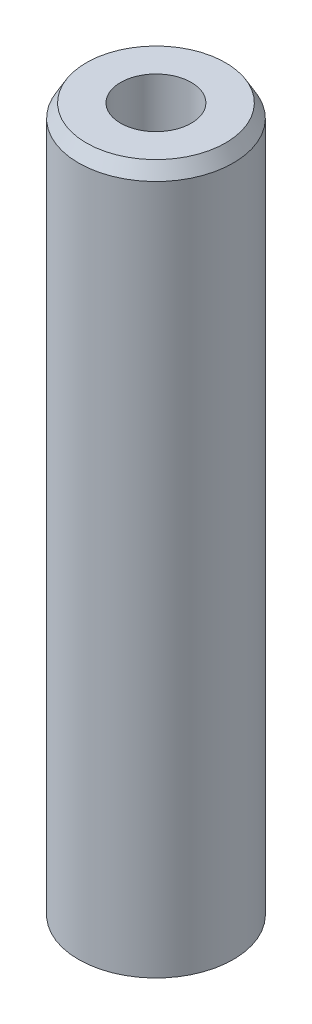
ISO-10303-21;
HEADER;
FILE_DESCRIPTION(('STEP AP214'),'2;1');
FILE_NAME('part.step','',(''),(''),'','','');
FILE_SCHEMA(('AUTOMOTIVE_DESIGN { 1 0 10303 214 1 1 1 1 }'));
ENDSEC;
DATA;
#1=APPLICATION_CONTEXT('core data for automotive mechanical design processes');
#2=APPLICATION_PROTOCOL_DEFINITION('international standard','automotive_design',2000,#1);
#3=PRODUCT_CONTEXT('',#1,'mechanical');
#4=PRODUCT('Part','Part','',(#3));
#5=PRODUCT_RELATED_PRODUCT_CATEGORY('part','',(#4));
#6=PRODUCT_DEFINITION_FORMATION('','',#4);
#7=PRODUCT_DEFINITION_CONTEXT('part definition',#1,'design');
#8=PRODUCT_DEFINITION('design','',#6,#7);
#9=PRODUCT_DEFINITION_SHAPE('','',#8);
#10=(LENGTH_UNIT() NAMED_UNIT(*) SI_UNIT(.MILLI.,.METRE.));
#11=(NAMED_UNIT(*) PLANE_ANGLE_UNIT() SI_UNIT($,.RADIAN.));
#12=(NAMED_UNIT(*) SI_UNIT($,.STERADIAN.) SOLID_ANGLE_UNIT());
#13=UNCERTAINTY_MEASURE_WITH_UNIT(LENGTH_MEASURE(1.E-05),#10,'distance_accuracy_value','');
#14=(GEOMETRIC_REPRESENTATION_CONTEXT(3) GLOBAL_UNCERTAINTY_ASSIGNED_CONTEXT((#13)) GLOBAL_UNIT_ASSIGNED_CONTEXT((#10,
#11,#12)) REPRESENTATION_CONTEXT('',''));
#15=CARTESIAN_POINT('',(0.,0.,0.));
#16=DIRECTION('',(0.,0.,1.));
#17=DIRECTION('',(1.,0.,0.));
#18=AXIS2_PLACEMENT_3D('',#15,#16,#17);
#19=CARTESIAN_POINT('',(0.,298.679103880782,0.));
#20=DIRECTION('',(0.,-1.,0.));
#21=DIRECTION('',(0.,0.,-1.));
#22=AXIS2_PLACEMENT_3D('',#19,#20,#21);
#23=CYLINDRICAL_SURFACE('',#22,32.5);
#24=CARTESIAN_POINT('',(0.,293.018940821755,0.));
#25=DIRECTION('',(0.,1.,0.));
#26=DIRECTION('',(0.,0.,1.));
#27=AXIS2_PLACEMENT_3D('',#24,#25,#26);
#28=CIRCLE('',#27,32.5);
#29=CARTESIAN_POINT('',(0.,293.018940821755,32.5));
#30=VERTEX_POINT('',#29);
#31=EDGE_CURVE('E50',#30,#30,#28,.F.);
#32=ORIENTED_EDGE('',*,*,#31,.T.);
#33=EDGE_LOOP('',(#32));
#34=FACE_BOUND('',#33,.T.);
#35=CARTESIAN_POINT('',(0.,3.26789666578603,0.));
#36=DIRECTION('',(0.,1.,0.));
#37=DIRECTION('',(0.,0.,1.));
#38=AXIS2_PLACEMENT_3D('',#35,#36,#37);
#39=CIRCLE('',#38,32.5);
#40=CARTESIAN_POINT('',(0.,3.26789666578603,32.5));
#41=VERTEX_POINT('',#40);
#42=EDGE_CURVE('E51',#41,#41,#39,.T.);
#43=ORIENTED_EDGE('',*,*,#42,.T.);
#44=EDGE_LOOP('',(#43));
#45=FACE_BOUND('',#44,.T.);
#46=ADVANCED_FACE('F39',(#34,#45),#23,.T.);
#47=CARTESIAN_POINT('',(0.,298.679103880782,0.));
#48=DIRECTION('',(0.,1.,0.));
#49=DIRECTION('',(0.,0.,1.));
#50=AXIS2_PLACEMENT_3D('',#47,#48,#49);
#51=PLANE('',#50);
#52=CARTESIAN_POINT('',(0.,298.679103880782,0.));
#53=DIRECTION('',(0.,1.,0.));
#54=DIRECTION('',(0.,0.,1.));
#55=AXIS2_PLACEMENT_3D('',#52,#53,#54);
#56=CIRCLE('',#55,29.232103334214);
#57=CARTESIAN_POINT('',(0.,298.679103880782,29.232103334214));
#58=VERTEX_POINT('',#57);
#59=EDGE_CURVE('E54',#58,#58,#56,.T.);
#60=ORIENTED_EDGE('',*,*,#59,.T.);
#61=EDGE_LOOP('',(#60));
#62=FACE_BOUND('',#61,.T.);
#63=CARTESIAN_POINT('',(0.,298.679103880782,0.));
#64=DIRECTION('',(0.,1.,0.));
#65=DIRECTION('',(0.,0.,1.));
#66=AXIS2_PLACEMENT_3D('',#63,#64,#65);
#67=CIRCLE('',#66,14.8529638655872);
#68=CARTESIAN_POINT('',(0.,298.679103880782,14.8529638655872));
#69=VERTEX_POINT('',#68);
#70=EDGE_CURVE('E58',#69,#69,#67,.T.);
#71=ORIENTED_EDGE('',*,*,#70,.F.);
#72=EDGE_LOOP('',(#71));
#73=FACE_BOUND('',#72,.T.);
#74=ADVANCED_FACE('F69',(#62,#73),#51,.T.);
#75=CARTESIAN_POINT('',(0.,0.,0.));
#76=DIRECTION('',(0.,1.,0.));
#77=DIRECTION('',(0.,0.,1.));
#78=AXIS2_PLACEMENT_3D('',#75,#76,#77);
#79=PLANE('',#78);
#80=CARTESIAN_POINT('',(0.,0.,0.));
#81=DIRECTION('',(0.,1.,0.));
#82=DIRECTION('',(0.,0.,1.));
#83=AXIS2_PLACEMENT_3D('',#80,#81,#82);
#84=CIRCLE('',#83,26.8398369409737);
#85=CARTESIAN_POINT('',(0.,0.,26.8398369409737));
#86=VERTEX_POINT('',#85);
#87=EDGE_CURVE('E10',#86,#86,#84,.F.);
#88=ORIENTED_EDGE('',*,*,#87,.T.);
#89=EDGE_LOOP('',(#88));
#90=FACE_BOUND('',#89,.T.);
#91=CARTESIAN_POINT('',(0.,0.,0.));
#92=DIRECTION('',(0.,1.,0.));
#93=DIRECTION('',(0.,0.,1.));
#94=AXIS2_PLACEMENT_3D('',#91,#92,#93);
#95=CIRCLE('',#94,14.8529638655872);
#96=CARTESIAN_POINT('',(0.,0.,14.8529638655872));
#97=VERTEX_POINT('',#96);
#98=EDGE_CURVE('E63',#97,#97,#95,.T.);
#99=ORIENTED_EDGE('',*,*,#98,.T.);
#100=EDGE_LOOP('',(#99));
#101=FACE_BOUND('',#100,.T.);
#102=ADVANCED_FACE('F75',(#90,#101),#79,.F.);
#103=CARTESIAN_POINT('',(0.,298.679103880782,0.));
#104=DIRECTION('',(0.,-1.,0.));
#105=DIRECTION('',(0.,0.,-1.));
#106=AXIS2_PLACEMENT_3D('',#103,#104,#105);
#107=CYLINDRICAL_SURFACE('',#106,14.8529638655872);
#108=ORIENTED_EDGE('',*,*,#70,.T.);
#109=EDGE_LOOP('',(#108));
#110=FACE_BOUND('',#109,.T.);
#111=ORIENTED_EDGE('',*,*,#98,.F.);
#112=EDGE_LOOP('',(#111));
#113=FACE_BOUND('',#112,.T.);
#114=ADVANCED_FACE('F70',(#110,#113),#107,.F.);
#115=CARTESIAN_POINT('',(0.,298.679103880782,0.));
#116=DIRECTION('',(0.,-1.,0.));
#117=DIRECTION('',(0.,0.,-1.));
#118=AXIS2_PLACEMENT_3D('',#115,#116,#117);
#119=CONICAL_SURFACE('',#118,29.232103334214,0.523598775598295);
#120=ORIENTED_EDGE('',*,*,#31,.F.);
#121=EDGE_LOOP('',(#120));
#122=FACE_BOUND('',#121,.T.);
#123=ORIENTED_EDGE('',*,*,#59,.F.);
#124=EDGE_LOOP('',(#123));
#125=FACE_BOUND('',#124,.T.);
#126=ADVANCED_FACE('F81',(#122,#125),#119,.T.);
#127=CARTESIAN_POINT('',(0.,3.26789666578603,0.));
#128=DIRECTION('',(0.,1.,0.));
#129=DIRECTION('',(0.,0.,1.));
#130=AXIS2_PLACEMENT_3D('',#127,#128,#129);
#131=CONICAL_SURFACE('',#130,32.5,1.0471975511966);
#132=ORIENTED_EDGE('',*,*,#87,.F.);
#133=EDGE_LOOP('',(#132));
#134=FACE_BOUND('',#133,.T.);
#135=ORIENTED_EDGE('',*,*,#42,.F.);
#136=EDGE_LOOP('',(#135));
#137=FACE_BOUND('',#136,.T.);
#138=ADVANCED_FACE('F45',(#134,#137),#131,.T.);
#139=CLOSED_SHELL('',(#46,#74,#102,#114,#126,#138));
#140=MANIFOLD_SOLID_BREP('B2',#139);
#141=ADVANCED_BREP_SHAPE_REPRESENTATION('',(#18,#140),#14);
#142=SHAPE_DEFINITION_REPRESENTATION(#9,#141);
ENDSEC;
END-ISO-10303-21;
